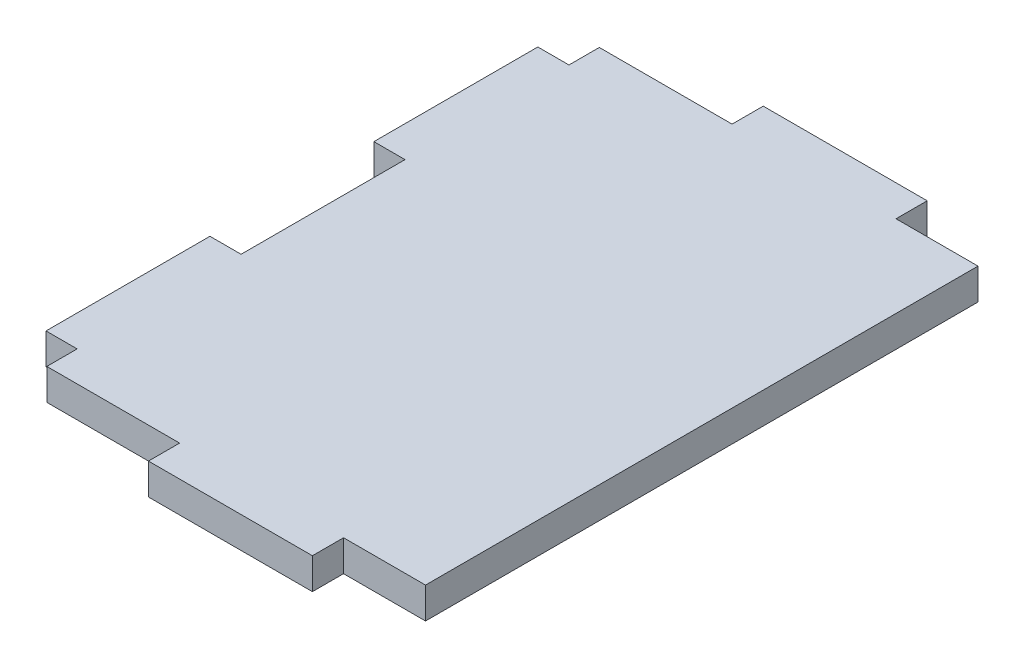
ISO-10303-21;
HEADER;
FILE_DESCRIPTION(('STEP AP214'),'2;1');
FILE_NAME('part.step','',(''),(''),'','','');
FILE_SCHEMA(('AUTOMOTIVE_DESIGN { 1 0 10303 214 1 1 1 1 }'));
ENDSEC;
DATA;
#1=APPLICATION_CONTEXT('core data for automotive mechanical design processes');
#2=APPLICATION_PROTOCOL_DEFINITION('international standard','automotive_design',2000,#1);
#3=PRODUCT_CONTEXT('',#1,'mechanical');
#4=PRODUCT('Part','Part','',(#3));
#5=PRODUCT_RELATED_PRODUCT_CATEGORY('part','',(#4));
#6=PRODUCT_DEFINITION_FORMATION('','',#4);
#7=PRODUCT_DEFINITION_CONTEXT('part definition',#1,'design');
#8=PRODUCT_DEFINITION('design','',#6,#7);
#9=PRODUCT_DEFINITION_SHAPE('','',#8);
#10=(LENGTH_UNIT() NAMED_UNIT(*) SI_UNIT(.MILLI.,.METRE.));
#11=(NAMED_UNIT(*) PLANE_ANGLE_UNIT() SI_UNIT($,.RADIAN.));
#12=(NAMED_UNIT(*) SI_UNIT($,.STERADIAN.) SOLID_ANGLE_UNIT());
#13=UNCERTAINTY_MEASURE_WITH_UNIT(LENGTH_MEASURE(1.E-05),#10,'distance_accuracy_value','');
#14=(GEOMETRIC_REPRESENTATION_CONTEXT(3) GLOBAL_UNCERTAINTY_ASSIGNED_CONTEXT((#13)) GLOBAL_UNIT_ASSIGNED_CONTEXT((#10,
#11,#12)) REPRESENTATION_CONTEXT('',''));
#15=CARTESIAN_POINT('',(0.,0.,0.));
#16=DIRECTION('',(0.,0.,1.));
#17=DIRECTION('',(1.,0.,0.));
#18=AXIS2_PLACEMENT_3D('',#15,#16,#17);
#19=CARTESIAN_POINT('',(4.82599999999999,4.826,-90.424));
#20=DIRECTION('',(1.,0.,0.));
#21=DIRECTION('',(0.,0.,-1.));
#22=AXIS2_PLACEMENT_3D('',#19,#20,#21);
#23=PLANE('',#22);
#24=DIRECTION('',(0.,0.,1.));
#25=VECTOR('',#24,1.);
#26=CARTESIAN_POINT('',(4.82599999999999,0.,-90.424));
#27=LINE('',#26,#25);
#28=CARTESIAN_POINT('',(4.82599999999999,0.,-90.424));
#29=VERTEX_POINT('',#28);
#30=CARTESIAN_POINT('',(4.82599999999999,0.,-85.725));
#31=VERTEX_POINT('',#30);
#32=EDGE_CURVE('E201',#29,#31,#27,.T.);
#33=ORIENTED_EDGE('',*,*,#32,.T.);
#34=DIRECTION('',(0.,-1.,0.));
#35=VECTOR('',#34,1.);
#36=CARTESIAN_POINT('',(4.82599999999999,4.826,-85.725));
#37=LINE('',#36,#35);
#38=CARTESIAN_POINT('',(4.82599999999999,4.826,-85.725));
#39=VERTEX_POINT('',#38);
#40=EDGE_CURVE('E11',#39,#31,#37,.T.);
#41=ORIENTED_EDGE('',*,*,#40,.F.);
#42=DIRECTION('',(0.,0.,1.));
#43=VECTOR('',#42,1.);
#44=CARTESIAN_POINT('',(4.82599999999999,4.826,-90.424));
#45=LINE('',#44,#43);
#46=CARTESIAN_POINT('',(4.82599999999999,4.826,-90.424));
#47=VERTEX_POINT('',#46);
#48=EDGE_CURVE('E239',#47,#39,#45,.T.);
#49=ORIENTED_EDGE('',*,*,#48,.F.);
#50=DIRECTION('',(0.,-1.,0.));
#51=VECTOR('',#50,1.);
#52=CARTESIAN_POINT('',(4.82599999999999,4.826,-90.424));
#53=LINE('',#52,#51);
#54=EDGE_CURVE('E197',#47,#29,#53,.T.);
#55=ORIENTED_EDGE('',*,*,#54,.T.);
#56=EDGE_LOOP('',(#33,#41,#49,#55));
#57=FACE_BOUND('',#56,.T.);
#58=ADVANCED_FACE('F33',(#57),#23,.F.);
#59=CARTESIAN_POINT('',(4.82599999999999,4.826,-85.725));
#60=DIRECTION('',(0.,0.,1.));
#61=DIRECTION('',(1.,0.,0.));
#62=AXIS2_PLACEMENT_3D('',#59,#60,#61);
#63=PLANE('',#62);
#64=DIRECTION('',(-1.,0.,0.));
#65=VECTOR('',#64,1.);
#66=CARTESIAN_POINT('',(4.82599999999999,0.,-85.725));
#67=LINE('',#66,#65);
#68=CARTESIAN_POINT('',(0.,0.,-85.725));
#69=VERTEX_POINT('',#68);
#70=EDGE_CURVE('E204',#31,#69,#67,.T.);
#71=ORIENTED_EDGE('',*,*,#70,.T.);
#72=DIRECTION('',(0.,-1.,0.));
#73=VECTOR('',#72,1.);
#74=CARTESIAN_POINT('',(0.,4.826,-85.725));
#75=LINE('',#74,#73);
#76=CARTESIAN_POINT('',(0.,4.826,-85.725));
#77=VERTEX_POINT('',#76);
#78=EDGE_CURVE('E41',#77,#69,#75,.T.);
#79=ORIENTED_EDGE('',*,*,#78,.F.);
#80=DIRECTION('',(-1.,0.,0.));
#81=VECTOR('',#80,1.);
#82=CARTESIAN_POINT('',(4.82599999999999,4.826,-85.725));
#83=LINE('',#82,#81);
#84=EDGE_CURVE('E128',#39,#77,#83,.T.);
#85=ORIENTED_EDGE('',*,*,#84,.F.);
#86=ORIENTED_EDGE('',*,*,#40,.T.);
#87=EDGE_LOOP('',(#71,#79,#85,#86));
#88=FACE_BOUND('',#87,.T.);
#89=ADVANCED_FACE('F357',(#88),#63,.F.);
#90=CARTESIAN_POINT('',(0.,4.826,-60.325));
#91=DIRECTION('',(1.,0.,0.));
#92=DIRECTION('',(0.,0.,-1.));
#93=AXIS2_PLACEMENT_3D('',#90,#91,#92);
#94=PLANE('',#93);
#95=DIRECTION('',(0.,0.,1.));
#96=VECTOR('',#95,1.);
#97=CARTESIAN_POINT('',(0.,0.,-60.325));
#98=LINE('',#97,#96);
#99=CARTESIAN_POINT('',(0.,0.,-60.325));
#100=VERTEX_POINT('',#99);
#101=EDGE_CURVE('E206',#69,#100,#98,.T.);
#102=ORIENTED_EDGE('',*,*,#101,.T.);
#103=DIRECTION('',(0.,-1.,0.));
#104=VECTOR('',#103,1.);
#105=CARTESIAN_POINT('',(0.,4.826,-60.325));
#106=LINE('',#105,#104);
#107=CARTESIAN_POINT('',(0.,4.826,-60.325));
#108=VERTEX_POINT('',#107);
#109=EDGE_CURVE('E282',#108,#100,#106,.T.);
#110=ORIENTED_EDGE('',*,*,#109,.F.);
#111=DIRECTION('',(0.,0.,1.));
#112=VECTOR('',#111,1.);
#113=CARTESIAN_POINT('',(0.,4.826,-60.325));
#114=LINE('',#113,#112);
#115=EDGE_CURVE('E290',#77,#108,#114,.T.);
#116=ORIENTED_EDGE('',*,*,#115,.F.);
#117=ORIENTED_EDGE('',*,*,#78,.T.);
#118=EDGE_LOOP('',(#102,#110,#116,#117));
#119=FACE_BOUND('',#118,.T.);
#120=ADVANCED_FACE('F288',(#119),#94,.F.);
#121=CARTESIAN_POINT('',(4.82599999999999,4.826,-60.325));
#122=DIRECTION('',(0.,0.,-1.));
#123=DIRECTION('',(-1.,0.,0.));
#124=AXIS2_PLACEMENT_3D('',#121,#122,#123);
#125=PLANE('',#124);
#126=DIRECTION('',(1.,0.,0.));
#127=VECTOR('',#126,1.);
#128=CARTESIAN_POINT('',(4.82599999999999,0.,-60.325));
#129=LINE('',#128,#127);
#130=CARTESIAN_POINT('',(4.82599999999999,0.,-60.325));
#131=VERTEX_POINT('',#130);
#132=EDGE_CURVE('E208',#100,#131,#129,.T.);
#133=ORIENTED_EDGE('',*,*,#132,.T.);
#134=DIRECTION('',(0.,-1.,0.));
#135=VECTOR('',#134,1.);
#136=CARTESIAN_POINT('',(4.82599999999999,4.826,-60.325));
#137=LINE('',#136,#135);
#138=CARTESIAN_POINT('',(4.82599999999999,4.826,-60.325));
#139=VERTEX_POINT('',#138);
#140=EDGE_CURVE('E279',#139,#131,#137,.T.);
#141=ORIENTED_EDGE('',*,*,#140,.F.);
#142=DIRECTION('',(1.,0.,0.));
#143=VECTOR('',#142,1.);
#144=CARTESIAN_POINT('',(4.82599999999999,4.826,-60.325));
#145=LINE('',#144,#143);
#146=EDGE_CURVE('E308',#108,#139,#145,.T.);
#147=ORIENTED_EDGE('',*,*,#146,.F.);
#148=ORIENTED_EDGE('',*,*,#109,.T.);
#149=EDGE_LOOP('',(#133,#141,#147,#148));
#150=FACE_BOUND('',#149,.T.);
#151=ADVANCED_FACE('F299',(#150),#125,.F.);
#152=CARTESIAN_POINT('',(4.82599999999999,4.826,-60.325));
#153=DIRECTION('',(1.,0.,0.));
#154=DIRECTION('',(0.,0.,-1.));
#155=AXIS2_PLACEMENT_3D('',#152,#153,#154);
#156=PLANE('',#155);
#157=DIRECTION('',(0.,0.,1.));
#158=VECTOR('',#157,1.);
#159=CARTESIAN_POINT('',(4.82599999999999,0.,-60.325));
#160=LINE('',#159,#158);
#161=CARTESIAN_POINT('',(4.82599999999999,0.,-34.925));
#162=VERTEX_POINT('',#161);
#163=EDGE_CURVE('E210',#131,#162,#160,.T.);
#164=ORIENTED_EDGE('',*,*,#163,.T.);
#165=DIRECTION('',(0.,-1.,0.));
#166=VECTOR('',#165,1.);
#167=CARTESIAN_POINT('',(4.82599999999999,4.826,-34.925));
#168=LINE('',#167,#166);
#169=CARTESIAN_POINT('',(4.82599999999999,4.826,-34.925));
#170=VERTEX_POINT('',#169);
#171=EDGE_CURVE('E276',#170,#162,#168,.T.);
#172=ORIENTED_EDGE('',*,*,#171,.F.);
#173=DIRECTION('',(0.,0.,1.));
#174=VECTOR('',#173,1.);
#175=CARTESIAN_POINT('',(4.82599999999999,4.826,-60.325));
#176=LINE('',#175,#174);
#177=EDGE_CURVE('E305',#139,#170,#176,.T.);
#178=ORIENTED_EDGE('',*,*,#177,.F.);
#179=ORIENTED_EDGE('',*,*,#140,.T.);
#180=EDGE_LOOP('',(#164,#172,#178,#179));
#181=FACE_BOUND('',#180,.T.);
#182=ADVANCED_FACE('F303',(#181),#156,.F.);
#183=CARTESIAN_POINT('',(4.82599999999999,4.826,-34.925));
#184=DIRECTION('',(0.,0.,1.));
#185=DIRECTION('',(1.,0.,0.));
#186=AXIS2_PLACEMENT_3D('',#183,#184,#185);
#187=PLANE('',#186);
#188=DIRECTION('',(-1.,0.,0.));
#189=VECTOR('',#188,1.);
#190=CARTESIAN_POINT('',(4.82599999999999,0.,-34.925));
#191=LINE('',#190,#189);
#192=CARTESIAN_POINT('',(0.,0.,-34.925));
#193=VERTEX_POINT('',#192);
#194=EDGE_CURVE('E212',#162,#193,#191,.T.);
#195=ORIENTED_EDGE('',*,*,#194,.T.);
#196=DIRECTION('',(0.,-1.,0.));
#197=VECTOR('',#196,1.);
#198=CARTESIAN_POINT('',(0.,4.826,-34.925));
#199=LINE('',#198,#197);
#200=CARTESIAN_POINT('',(0.,4.826,-34.925));
#201=VERTEX_POINT('',#200);
#202=EDGE_CURVE('E273',#201,#193,#199,.T.);
#203=ORIENTED_EDGE('',*,*,#202,.F.);
#204=DIRECTION('',(-1.,0.,0.));
#205=VECTOR('',#204,1.);
#206=CARTESIAN_POINT('',(4.82599999999999,4.826,-34.925));
#207=LINE('',#206,#205);
#208=EDGE_CURVE('E307',#170,#201,#207,.T.);
#209=ORIENTED_EDGE('',*,*,#208,.F.);
#210=ORIENTED_EDGE('',*,*,#171,.T.);
#211=EDGE_LOOP('',(#195,#203,#209,#210));
#212=FACE_BOUND('',#211,.T.);
#213=ADVANCED_FACE('F370',(#212),#187,.F.);
#214=CARTESIAN_POINT('',(0.,4.826,-9.52500000000001));
#215=DIRECTION('',(1.,0.,0.));
#216=DIRECTION('',(0.,0.,-1.));
#217=AXIS2_PLACEMENT_3D('',#214,#215,#216);
#218=PLANE('',#217);
#219=DIRECTION('',(0.,0.,1.));
#220=VECTOR('',#219,1.);
#221=CARTESIAN_POINT('',(0.,0.,-9.52500000000001));
#222=LINE('',#221,#220);
#223=CARTESIAN_POINT('',(0.,0.,-9.52500000000001));
#224=VERTEX_POINT('',#223);
#225=EDGE_CURVE('E214',#193,#224,#222,.T.);
#226=ORIENTED_EDGE('',*,*,#225,.T.);
#227=DIRECTION('',(0.,-1.,0.));
#228=VECTOR('',#227,1.);
#229=CARTESIAN_POINT('',(0.,4.826,-9.52500000000001));
#230=LINE('',#229,#228);
#231=CARTESIAN_POINT('',(0.,4.826,-9.52500000000001));
#232=VERTEX_POINT('',#231);
#233=EDGE_CURVE('E270',#232,#224,#230,.T.);
#234=ORIENTED_EDGE('',*,*,#233,.F.);
#235=DIRECTION('',(0.,0.,1.));
#236=VECTOR('',#235,1.);
#237=CARTESIAN_POINT('',(0.,4.826,-9.52500000000001));
#238=LINE('',#237,#236);
#239=EDGE_CURVE('E310',#201,#232,#238,.T.);
#240=ORIENTED_EDGE('',*,*,#239,.F.);
#241=ORIENTED_EDGE('',*,*,#202,.T.);
#242=EDGE_LOOP('',(#226,#234,#240,#241));
#243=FACE_BOUND('',#242,.T.);
#244=ADVANCED_FACE('F373',(#243),#218,.F.);
#245=CARTESIAN_POINT('',(4.82599999999999,4.826,-9.52500000000001));
#246=DIRECTION('',(0.,0.,-1.));
#247=DIRECTION('',(-1.,0.,0.));
#248=AXIS2_PLACEMENT_3D('',#245,#246,#247);
#249=PLANE('',#248);
#250=DIRECTION('',(1.,0.,0.));
#251=VECTOR('',#250,1.);
#252=CARTESIAN_POINT('',(4.82599999999999,0.,-9.52500000000001));
#253=LINE('',#252,#251);
#254=CARTESIAN_POINT('',(4.82599999999999,0.,-9.52500000000001));
#255=VERTEX_POINT('',#254);
#256=EDGE_CURVE('E216',#224,#255,#253,.T.);
#257=ORIENTED_EDGE('',*,*,#256,.T.);
#258=DIRECTION('',(0.,-1.,0.));
#259=VECTOR('',#258,1.);
#260=CARTESIAN_POINT('',(4.82599999999999,4.826,-9.52500000000001));
#261=LINE('',#260,#259);
#262=CARTESIAN_POINT('',(4.82599999999999,4.826,-9.52500000000001));
#263=VERTEX_POINT('',#262);
#264=EDGE_CURVE('E267',#263,#255,#261,.T.);
#265=ORIENTED_EDGE('',*,*,#264,.F.);
#266=DIRECTION('',(1.,0.,0.));
#267=VECTOR('',#266,1.);
#268=CARTESIAN_POINT('',(4.82599999999999,4.826,-9.52500000000001));
#269=LINE('',#268,#267);
#270=EDGE_CURVE('E316',#232,#263,#269,.T.);
#271=ORIENTED_EDGE('',*,*,#270,.F.);
#272=ORIENTED_EDGE('',*,*,#233,.T.);
#273=EDGE_LOOP('',(#257,#265,#271,#272));
#274=FACE_BOUND('',#273,.T.);
#275=ADVANCED_FACE('F377',(#274),#249,.F.);
#276=CARTESIAN_POINT('',(4.82599999999999,4.826,-9.52500000000001));
#277=DIRECTION('',(1.,0.,0.));
#278=DIRECTION('',(0.,0.,-1.));
#279=AXIS2_PLACEMENT_3D('',#276,#277,#278);
#280=PLANE('',#279);
#281=DIRECTION('',(0.,0.,1.));
#282=VECTOR('',#281,1.);
#283=CARTESIAN_POINT('',(4.82599999999999,0.,-9.52500000000001));
#284=LINE('',#283,#282);
#285=CARTESIAN_POINT('',(4.826,0.,-4.826));
#286=VERTEX_POINT('',#285);
#287=EDGE_CURVE('E218',#255,#286,#284,.T.);
#288=ORIENTED_EDGE('',*,*,#287,.T.);
#289=DIRECTION('',(0.,-1.,0.));
#290=VECTOR('',#289,1.);
#291=CARTESIAN_POINT('',(4.826,4.826,-4.826));
#292=LINE('',#291,#290);
#293=CARTESIAN_POINT('',(4.826,4.826,-4.826));
#294=VERTEX_POINT('',#293);
#295=EDGE_CURVE('E264',#294,#286,#292,.T.);
#296=ORIENTED_EDGE('',*,*,#295,.F.);
#297=DIRECTION('',(0.,0.,1.));
#298=VECTOR('',#297,1.);
#299=CARTESIAN_POINT('',(4.82599999999999,4.826,-9.52500000000001));
#300=LINE('',#299,#298);
#301=EDGE_CURVE('E318',#263,#294,#300,.T.);
#302=ORIENTED_EDGE('',*,*,#301,.F.);
#303=ORIENTED_EDGE('',*,*,#264,.T.);
#304=EDGE_LOOP('',(#288,#296,#302,#303));
#305=FACE_BOUND('',#304,.T.);
#306=ADVANCED_FACE('F381',(#305),#280,.F.);
#307=CARTESIAN_POINT('',(4.826,4.826,-4.826));
#308=DIRECTION('',(0.,0.,-1.));
#309=DIRECTION('',(-1.,0.,0.));
#310=AXIS2_PLACEMENT_3D('',#307,#308,#309);
#311=PLANE('',#310);
#312=DIRECTION('',(1.,0.,0.));
#313=VECTOR('',#312,1.);
#314=CARTESIAN_POINT('',(4.826,0.,-4.826));
#315=LINE('',#314,#313);
#316=CARTESIAN_POINT('',(25.4,0.,-4.82599999999999));
#317=VERTEX_POINT('',#316);
#318=EDGE_CURVE('E220',#286,#317,#315,.T.);
#319=ORIENTED_EDGE('',*,*,#318,.T.);
#320=DIRECTION('',(0.,-1.,0.));
#321=VECTOR('',#320,1.);
#322=CARTESIAN_POINT('',(25.4,4.826,-4.82599999999999));
#323=LINE('',#322,#321);
#324=CARTESIAN_POINT('',(25.4,4.826,-4.82599999999999));
#325=VERTEX_POINT('',#324);
#326=EDGE_CURVE('E261',#325,#317,#323,.T.);
#327=ORIENTED_EDGE('',*,*,#326,.F.);
#328=DIRECTION('',(1.,0.,0.));
#329=VECTOR('',#328,1.);
#330=CARTESIAN_POINT('',(4.826,4.826,-4.826));
#331=LINE('',#330,#329);
#332=EDGE_CURVE('E320',#294,#325,#331,.T.);
#333=ORIENTED_EDGE('',*,*,#332,.F.);
#334=ORIENTED_EDGE('',*,*,#295,.T.);
#335=EDGE_LOOP('',(#319,#327,#333,#334));
#336=FACE_BOUND('',#335,.T.);
#337=ADVANCED_FACE('F385',(#336),#311,.F.);
#338=CARTESIAN_POINT('',(25.4,4.826,-4.82599999999999));
#339=DIRECTION('',(1.,0.,0.));
#340=DIRECTION('',(0.,0.,-1.));
#341=AXIS2_PLACEMENT_3D('',#338,#339,#340);
#342=PLANE('',#341);
#343=DIRECTION('',(0.,0.,1.));
#344=VECTOR('',#343,1.);
#345=CARTESIAN_POINT('',(25.4,0.,-4.82599999999999));
#346=LINE('',#345,#344);
#347=CARTESIAN_POINT('',(25.4,0.,0.));
#348=VERTEX_POINT('',#347);
#349=EDGE_CURVE('E222',#317,#348,#346,.T.);
#350=ORIENTED_EDGE('',*,*,#349,.T.);
#351=DIRECTION('',(0.,-1.,0.));
#352=VECTOR('',#351,1.);
#353=CARTESIAN_POINT('',(25.4,4.826,0.));
#354=LINE('',#353,#352);
#355=CARTESIAN_POINT('',(25.4,4.826,0.));
#356=VERTEX_POINT('',#355);
#357=EDGE_CURVE('E258',#356,#348,#354,.T.);
#358=ORIENTED_EDGE('',*,*,#357,.F.);
#359=DIRECTION('',(0.,0.,1.));
#360=VECTOR('',#359,1.);
#361=CARTESIAN_POINT('',(25.4,4.826,-4.82599999999999));
#362=LINE('',#361,#360);
#363=EDGE_CURVE('E322',#325,#356,#362,.T.);
#364=ORIENTED_EDGE('',*,*,#363,.F.);
#365=ORIENTED_EDGE('',*,*,#326,.T.);
#366=EDGE_LOOP('',(#350,#358,#364,#365));
#367=FACE_BOUND('',#366,.T.);
#368=ADVANCED_FACE('F389',(#367),#342,.F.);
#369=CARTESIAN_POINT('',(50.8,4.826,0.));
#370=DIRECTION('',(0.,0.,-1.));
#371=DIRECTION('',(-1.,0.,0.));
#372=AXIS2_PLACEMENT_3D('',#369,#370,#371);
#373=PLANE('',#372);
#374=DIRECTION('',(1.,0.,0.));
#375=VECTOR('',#374,1.);
#376=CARTESIAN_POINT('',(50.8,0.,0.));
#377=LINE('',#376,#375);
#378=CARTESIAN_POINT('',(50.8,0.,0.));
#379=VERTEX_POINT('',#378);
#380=EDGE_CURVE('E224',#348,#379,#377,.T.);
#381=ORIENTED_EDGE('',*,*,#380,.T.);
#382=DIRECTION('',(0.,-1.,0.));
#383=VECTOR('',#382,1.);
#384=CARTESIAN_POINT('',(50.8,4.826,0.));
#385=LINE('',#384,#383);
#386=CARTESIAN_POINT('',(50.8,4.826,0.));
#387=VERTEX_POINT('',#386);
#388=EDGE_CURVE('E255',#387,#379,#385,.T.);
#389=ORIENTED_EDGE('',*,*,#388,.F.);
#390=DIRECTION('',(1.,0.,0.));
#391=VECTOR('',#390,1.);
#392=CARTESIAN_POINT('',(50.8,4.826,0.));
#393=LINE('',#392,#391);
#394=EDGE_CURVE('E324',#356,#387,#393,.T.);
#395=ORIENTED_EDGE('',*,*,#394,.F.);
#396=ORIENTED_EDGE('',*,*,#357,.T.);
#397=EDGE_LOOP('',(#381,#389,#395,#396));
#398=FACE_BOUND('',#397,.T.);
#399=ADVANCED_FACE('F393',(#398),#373,.F.);
#400=CARTESIAN_POINT('',(50.8,4.826,-4.826));
#401=DIRECTION('',(-1.,0.,0.));
#402=DIRECTION('',(0.,0.,1.));
#403=AXIS2_PLACEMENT_3D('',#400,#401,#402);
#404=PLANE('',#403);
#405=DIRECTION('',(0.,0.,-1.));
#406=VECTOR('',#405,1.);
#407=CARTESIAN_POINT('',(50.8,0.,-4.826));
#408=LINE('',#407,#406);
#409=CARTESIAN_POINT('',(50.8,0.,-4.826));
#410=VERTEX_POINT('',#409);
#411=EDGE_CURVE('E226',#379,#410,#408,.T.);
#412=ORIENTED_EDGE('',*,*,#411,.T.);
#413=DIRECTION('',(0.,-1.,0.));
#414=VECTOR('',#413,1.);
#415=CARTESIAN_POINT('',(50.8,4.826,-4.826));
#416=LINE('',#415,#414);
#417=CARTESIAN_POINT('',(50.8,4.826,-4.826));
#418=VERTEX_POINT('',#417);
#419=EDGE_CURVE('E252',#418,#410,#416,.T.);
#420=ORIENTED_EDGE('',*,*,#419,.F.);
#421=DIRECTION('',(0.,0.,-1.));
#422=VECTOR('',#421,1.);
#423=CARTESIAN_POINT('',(50.8,4.826,-4.826));
#424=LINE('',#423,#422);
#425=EDGE_CURVE('E326',#387,#418,#424,.T.);
#426=ORIENTED_EDGE('',*,*,#425,.F.);
#427=ORIENTED_EDGE('',*,*,#388,.T.);
#428=EDGE_LOOP('',(#412,#420,#426,#427));
#429=FACE_BOUND('',#428,.T.);
#430=ADVANCED_FACE('F397',(#429),#404,.F.);
#431=CARTESIAN_POINT('',(50.8,4.826,-4.826));
#432=DIRECTION('',(0.,0.,-1.));
#433=DIRECTION('',(-1.,0.,0.));
#434=AXIS2_PLACEMENT_3D('',#431,#432,#433);
#435=PLANE('',#434);
#436=DIRECTION('',(1.,0.,0.));
#437=VECTOR('',#436,1.);
#438=CARTESIAN_POINT('',(50.8,0.,-4.826));
#439=LINE('',#438,#437);
#440=CARTESIAN_POINT('',(63.5,0.,-4.826));
#441=VERTEX_POINT('',#440);
#442=EDGE_CURVE('E228',#410,#441,#439,.T.);
#443=ORIENTED_EDGE('',*,*,#442,.T.);
#444=DIRECTION('',(0.,-1.,0.));
#445=VECTOR('',#444,1.);
#446=CARTESIAN_POINT('',(63.5,4.826,-4.826));
#447=LINE('',#446,#445);
#448=CARTESIAN_POINT('',(63.5,4.826,-4.826));
#449=VERTEX_POINT('',#448);
#450=EDGE_CURVE('E249',#449,#441,#447,.T.);
#451=ORIENTED_EDGE('',*,*,#450,.F.);
#452=DIRECTION('',(1.,0.,0.));
#453=VECTOR('',#452,1.);
#454=CARTESIAN_POINT('',(50.8,4.826,-4.826));
#455=LINE('',#454,#453);
#456=EDGE_CURVE('E328',#418,#449,#455,.T.);
#457=ORIENTED_EDGE('',*,*,#456,.F.);
#458=ORIENTED_EDGE('',*,*,#419,.T.);
#459=EDGE_LOOP('',(#443,#451,#457,#458));
#460=FACE_BOUND('',#459,.T.);
#461=ADVANCED_FACE('F401',(#460),#435,.F.);
#462=CARTESIAN_POINT('',(63.5,4.826,-90.424));
#463=DIRECTION('',(-1.,0.,0.));
#464=DIRECTION('',(0.,0.,1.));
#465=AXIS2_PLACEMENT_3D('',#462,#463,#464);
#466=PLANE('',#465);
#467=DIRECTION('',(0.,0.,-1.));
#468=VECTOR('',#467,1.);
#469=CARTESIAN_POINT('',(63.5,0.,-90.424));
#470=LINE('',#469,#468);
#471=CARTESIAN_POINT('',(63.5,0.,-90.424));
#472=VERTEX_POINT('',#471);
#473=EDGE_CURVE('E230',#441,#472,#470,.T.);
#474=ORIENTED_EDGE('',*,*,#473,.T.);
#475=DIRECTION('',(0.,-1.,0.));
#476=VECTOR('',#475,1.);
#477=CARTESIAN_POINT('',(63.5,4.826,-90.424));
#478=LINE('',#477,#476);
#479=CARTESIAN_POINT('',(63.5,4.826,-90.424));
#480=VERTEX_POINT('',#479);
#481=EDGE_CURVE('E246',#480,#472,#478,.T.);
#482=ORIENTED_EDGE('',*,*,#481,.F.);
#483=DIRECTION('',(0.,0.,-1.));
#484=VECTOR('',#483,1.);
#485=CARTESIAN_POINT('',(63.5,4.826,-90.424));
#486=LINE('',#485,#484);
#487=EDGE_CURVE('E330',#449,#480,#486,.T.);
#488=ORIENTED_EDGE('',*,*,#487,.F.);
#489=ORIENTED_EDGE('',*,*,#450,.T.);
#490=EDGE_LOOP('',(#474,#482,#488,#489));
#491=FACE_BOUND('',#490,.T.);
#492=ADVANCED_FACE('F405',(#491),#466,.F.);
#493=CARTESIAN_POINT('',(50.8,4.826,-90.424));
#494=DIRECTION('',(0.,0.,1.));
#495=DIRECTION('',(1.,0.,0.));
#496=AXIS2_PLACEMENT_3D('',#493,#494,#495);
#497=PLANE('',#496);
#498=DIRECTION('',(-1.,0.,0.));
#499=VECTOR('',#498,1.);
#500=CARTESIAN_POINT('',(50.8,0.,-90.424));
#501=LINE('',#500,#499);
#502=CARTESIAN_POINT('',(50.8,0.,-90.424));
#503=VERTEX_POINT('',#502);
#504=EDGE_CURVE('E232',#472,#503,#501,.T.);
#505=ORIENTED_EDGE('',*,*,#504,.T.);
#506=DIRECTION('',(0.,-1.,0.));
#507=VECTOR('',#506,1.);
#508=CARTESIAN_POINT('',(50.8,4.826,-90.424));
#509=LINE('',#508,#507);
#510=CARTESIAN_POINT('',(50.8,4.826,-90.424));
#511=VERTEX_POINT('',#510);
#512=EDGE_CURVE('E243',#511,#503,#509,.T.);
#513=ORIENTED_EDGE('',*,*,#512,.F.);
#514=DIRECTION('',(-1.,0.,0.));
#515=VECTOR('',#514,1.);
#516=CARTESIAN_POINT('',(50.8,4.826,-90.424));
#517=LINE('',#516,#515);
#518=EDGE_CURVE('E332',#480,#511,#517,.T.);
#519=ORIENTED_EDGE('',*,*,#518,.F.);
#520=ORIENTED_EDGE('',*,*,#481,.T.);
#521=EDGE_LOOP('',(#505,#513,#519,#520));
#522=FACE_BOUND('',#521,.T.);
#523=ADVANCED_FACE('F338',(#522),#497,.F.);
#524=CARTESIAN_POINT('',(50.8,4.826,-90.424));
#525=DIRECTION('',(-1.,0.,0.));
#526=DIRECTION('',(0.,0.,1.));
#527=AXIS2_PLACEMENT_3D('',#524,#525,#526);
#528=PLANE('',#527);
#529=DIRECTION('',(0.,0.,-1.));
#530=VECTOR('',#529,1.);
#531=CARTESIAN_POINT('',(50.8,0.,-90.424));
#532=LINE('',#531,#530);
#533=CARTESIAN_POINT('',(50.8,0.,-95.25));
#534=VERTEX_POINT('',#533);
#535=EDGE_CURVE('E234',#503,#534,#532,.T.);
#536=ORIENTED_EDGE('',*,*,#535,.T.);
#537=DIRECTION('',(0.,-1.,0.));
#538=VECTOR('',#537,1.);
#539=CARTESIAN_POINT('',(50.8,4.826,-95.25));
#540=LINE('',#539,#538);
#541=CARTESIAN_POINT('',(50.8,4.826,-95.25));
#542=VERTEX_POINT('',#541);
#543=EDGE_CURVE('E192',#542,#534,#540,.T.);
#544=ORIENTED_EDGE('',*,*,#543,.F.);
#545=DIRECTION('',(0.,0.,-1.));
#546=VECTOR('',#545,1.);
#547=CARTESIAN_POINT('',(50.8,4.826,-90.424));
#548=LINE('',#547,#546);
#549=EDGE_CURVE('E183',#511,#542,#548,.T.);
#550=ORIENTED_EDGE('',*,*,#549,.F.);
#551=ORIENTED_EDGE('',*,*,#512,.T.);
#552=EDGE_LOOP('',(#536,#544,#550,#551));
#553=FACE_BOUND('',#552,.T.);
#554=ADVANCED_FACE('F342',(#553),#528,.F.);
#555=CARTESIAN_POINT('',(25.4,4.826,-95.25));
#556=DIRECTION('',(0.,0.,1.));
#557=DIRECTION('',(1.,0.,0.));
#558=AXIS2_PLACEMENT_3D('',#555,#556,#557);
#559=PLANE('',#558);
#560=DIRECTION('',(-1.,0.,0.));
#561=VECTOR('',#560,1.);
#562=CARTESIAN_POINT('',(25.4,0.,-95.25));
#563=LINE('',#562,#561);
#564=CARTESIAN_POINT('',(25.4,0.,-95.25));
#565=VERTEX_POINT('',#564);
#566=EDGE_CURVE('E191',#534,#565,#563,.T.);
#567=ORIENTED_EDGE('',*,*,#566,.T.);
#568=DIRECTION('',(0.,-1.,0.));
#569=VECTOR('',#568,1.);
#570=CARTESIAN_POINT('',(25.4,4.826,-95.25));
#571=LINE('',#570,#569);
#572=CARTESIAN_POINT('',(25.4,4.826,-95.25));
#573=VERTEX_POINT('',#572);
#574=EDGE_CURVE('E188',#573,#565,#571,.T.);
#575=ORIENTED_EDGE('',*,*,#574,.F.);
#576=DIRECTION('',(-1.,0.,0.));
#577=VECTOR('',#576,1.);
#578=CARTESIAN_POINT('',(25.4,4.826,-95.25));
#579=LINE('',#578,#577);
#580=EDGE_CURVE('E177',#542,#573,#579,.T.);
#581=ORIENTED_EDGE('',*,*,#580,.F.);
#582=ORIENTED_EDGE('',*,*,#543,.T.);
#583=EDGE_LOOP('',(#567,#575,#581,#582));
#584=FACE_BOUND('',#583,.T.);
#585=ADVANCED_FACE('F189',(#584),#559,.F.);
#586=CARTESIAN_POINT('',(25.4,4.826,-90.424));
#587=DIRECTION('',(1.,0.,0.));
#588=DIRECTION('',(0.,0.,-1.));
#589=AXIS2_PLACEMENT_3D('',#586,#587,#588);
#590=PLANE('',#589);
#591=DIRECTION('',(0.,0.,1.));
#592=VECTOR('',#591,1.);
#593=CARTESIAN_POINT('',(25.4,0.,-90.424));
#594=LINE('',#593,#592);
#595=CARTESIAN_POINT('',(25.4,0.,-90.424));
#596=VERTEX_POINT('',#595);
#597=EDGE_CURVE('E114',#565,#596,#594,.T.);
#598=ORIENTED_EDGE('',*,*,#597,.T.);
#599=DIRECTION('',(0.,-1.,0.));
#600=VECTOR('',#599,1.);
#601=CARTESIAN_POINT('',(25.4,4.826,-90.424));
#602=LINE('',#601,#600);
#603=CARTESIAN_POINT('',(25.4,4.826,-90.424));
#604=VERTEX_POINT('',#603);
#605=EDGE_CURVE('E193',#604,#596,#602,.T.);
#606=ORIENTED_EDGE('',*,*,#605,.F.);
#607=DIRECTION('',(0.,0.,1.));
#608=VECTOR('',#607,1.);
#609=CARTESIAN_POINT('',(25.4,4.826,-90.424));
#610=LINE('',#609,#608);
#611=EDGE_CURVE('E181',#573,#604,#610,.T.);
#612=ORIENTED_EDGE('',*,*,#611,.F.);
#613=ORIENTED_EDGE('',*,*,#574,.T.);
#614=EDGE_LOOP('',(#598,#606,#612,#613));
#615=FACE_BOUND('',#614,.T.);
#616=ADVANCED_FACE('F195',(#615),#590,.F.);
#617=CARTESIAN_POINT('',(4.82599999999999,4.826,-90.424));
#618=DIRECTION('',(0.,0.,1.));
#619=DIRECTION('',(1.,0.,0.));
#620=AXIS2_PLACEMENT_3D('',#617,#618,#619);
#621=PLANE('',#620);
#622=DIRECTION('',(-1.,0.,0.));
#623=VECTOR('',#622,1.);
#624=CARTESIAN_POINT('',(4.82599999999999,0.,-90.424));
#625=LINE('',#624,#623);
#626=EDGE_CURVE('E120',#596,#29,#625,.T.);
#627=ORIENTED_EDGE('',*,*,#626,.T.);
#628=ORIENTED_EDGE('',*,*,#54,.F.);
#629=DIRECTION('',(-1.,0.,0.));
#630=VECTOR('',#629,1.);
#631=CARTESIAN_POINT('',(4.82599999999999,4.826,-90.424));
#632=LINE('',#631,#630);
#633=EDGE_CURVE('E49',#604,#47,#632,.T.);
#634=ORIENTED_EDGE('',*,*,#633,.F.);
#635=ORIENTED_EDGE('',*,*,#605,.T.);
#636=EDGE_LOOP('',(#627,#628,#634,#635));
#637=FACE_BOUND('',#636,.T.);
#638=ADVANCED_FACE('F346',(#637),#621,.F.);
#639=CARTESIAN_POINT('',(0.,4.826,0.));
#640=DIRECTION('',(0.,-1.,0.));
#641=DIRECTION('',(0.,0.,-1.));
#642=AXIS2_PLACEMENT_3D('',#639,#640,#641);
#643=PLANE('',#642);
#644=ORIENTED_EDGE('',*,*,#48,.T.);
#645=ORIENTED_EDGE('',*,*,#84,.T.);
#646=ORIENTED_EDGE('',*,*,#115,.T.);
#647=ORIENTED_EDGE('',*,*,#146,.T.);
#648=ORIENTED_EDGE('',*,*,#177,.T.);
#649=ORIENTED_EDGE('',*,*,#208,.T.);
#650=ORIENTED_EDGE('',*,*,#239,.T.);
#651=ORIENTED_EDGE('',*,*,#270,.T.);
#652=ORIENTED_EDGE('',*,*,#301,.T.);
#653=ORIENTED_EDGE('',*,*,#332,.T.);
#654=ORIENTED_EDGE('',*,*,#363,.T.);
#655=ORIENTED_EDGE('',*,*,#394,.T.);
#656=ORIENTED_EDGE('',*,*,#425,.T.);
#657=ORIENTED_EDGE('',*,*,#456,.T.);
#658=ORIENTED_EDGE('',*,*,#487,.T.);
#659=ORIENTED_EDGE('',*,*,#518,.T.);
#660=ORIENTED_EDGE('',*,*,#549,.T.);
#661=ORIENTED_EDGE('',*,*,#580,.T.);
#662=ORIENTED_EDGE('',*,*,#611,.T.);
#663=ORIENTED_EDGE('',*,*,#633,.T.);
#664=EDGE_LOOP('',(#644,#645,#646,#647,#648,#649,#650,#651,#652,#653,#654,#655,#656,#657,#658,
#659,#660,#661,#662,#663));
#665=FACE_BOUND('',#664,.T.);
#666=ADVANCED_FACE('F179',(#665),#643,.F.);
#667=CARTESIAN_POINT('',(0.,0.,0.));
#668=DIRECTION('',(0.,-1.,0.));
#669=DIRECTION('',(0.,0.,-1.));
#670=AXIS2_PLACEMENT_3D('',#667,#668,#669);
#671=PLANE('',#670);
#672=ORIENTED_EDGE('',*,*,#32,.F.);
#673=ORIENTED_EDGE('',*,*,#626,.F.);
#674=ORIENTED_EDGE('',*,*,#597,.F.);
#675=ORIENTED_EDGE('',*,*,#566,.F.);
#676=ORIENTED_EDGE('',*,*,#535,.F.);
#677=ORIENTED_EDGE('',*,*,#504,.F.);
#678=ORIENTED_EDGE('',*,*,#473,.F.);
#679=ORIENTED_EDGE('',*,*,#442,.F.);
#680=ORIENTED_EDGE('',*,*,#411,.F.);
#681=ORIENTED_EDGE('',*,*,#380,.F.);
#682=ORIENTED_EDGE('',*,*,#349,.F.);
#683=ORIENTED_EDGE('',*,*,#318,.F.);
#684=ORIENTED_EDGE('',*,*,#287,.F.);
#685=ORIENTED_EDGE('',*,*,#256,.F.);
#686=ORIENTED_EDGE('',*,*,#225,.F.);
#687=ORIENTED_EDGE('',*,*,#194,.F.);
#688=ORIENTED_EDGE('',*,*,#163,.F.);
#689=ORIENTED_EDGE('',*,*,#132,.F.);
#690=ORIENTED_EDGE('',*,*,#101,.F.);
#691=ORIENTED_EDGE('',*,*,#70,.F.);
#692=EDGE_LOOP('',(#672,#673,#674,#675,#676,#677,#678,#679,#680,#681,#682,#683,#684,#685,#686,
#687,#688,#689,#690,#691));
#693=FACE_BOUND('',#692,.T.);
#694=ADVANCED_FACE('F294',(#693),#671,.T.);
#695=CLOSED_SHELL('',(#58,#89,#120,#151,#182,#213,#244,#275,#306,#337,#368,#399,#430,#461,#492,
#523,#554,#585,#616,#638,#666,#694));
#696=MANIFOLD_SOLID_BREP('B2',#695);
#697=ADVANCED_BREP_SHAPE_REPRESENTATION('',(#18,#696),#14);
#698=SHAPE_DEFINITION_REPRESENTATION(#9,#697);
ENDSEC;
END-ISO-10303-21;
